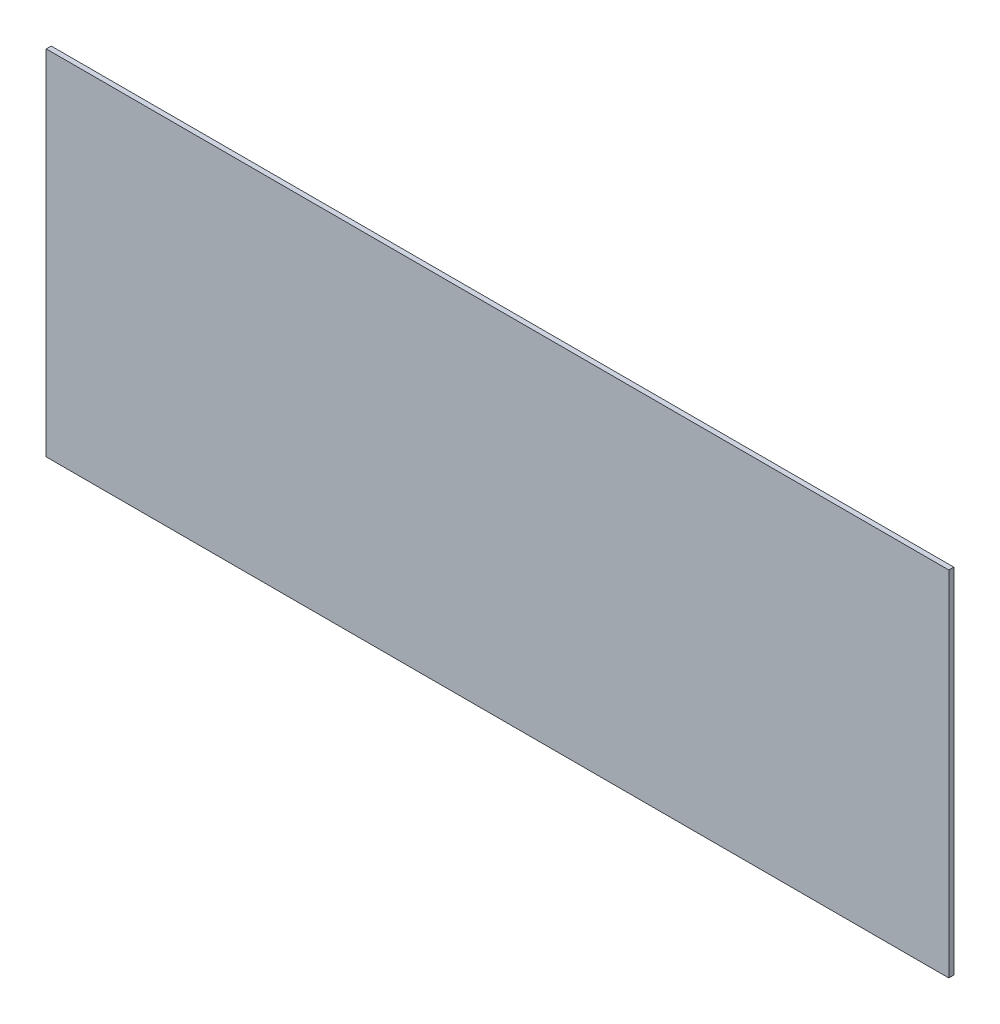
ISO-10303-21;
HEADER;
FILE_DESCRIPTION(('STEP AP214'),'2;1');
FILE_NAME('part.step','',(''),(''),'','','');
FILE_SCHEMA(('AUTOMOTIVE_DESIGN { 1 0 10303 214 1 1 1 1 }'));
ENDSEC;
DATA;
#1=APPLICATION_CONTEXT('core data for automotive mechanical design processes');
#2=APPLICATION_PROTOCOL_DEFINITION('international standard','automotive_design',2000,#1);
#3=PRODUCT_CONTEXT('',#1,'mechanical');
#4=PRODUCT('Part','Part','',(#3));
#5=PRODUCT_RELATED_PRODUCT_CATEGORY('part','',(#4));
#6=PRODUCT_DEFINITION_FORMATION('','',#4);
#7=PRODUCT_DEFINITION_CONTEXT('part definition',#1,'design');
#8=PRODUCT_DEFINITION('design','',#6,#7);
#9=PRODUCT_DEFINITION_SHAPE('','',#8);
#10=(LENGTH_UNIT() NAMED_UNIT(*) SI_UNIT(.MILLI.,.METRE.));
#11=(NAMED_UNIT(*) PLANE_ANGLE_UNIT() SI_UNIT($,.RADIAN.));
#12=(NAMED_UNIT(*) SI_UNIT($,.STERADIAN.) SOLID_ANGLE_UNIT());
#13=UNCERTAINTY_MEASURE_WITH_UNIT(LENGTH_MEASURE(1.E-05),#10,'distance_accuracy_value','');
#14=(GEOMETRIC_REPRESENTATION_CONTEXT(3) GLOBAL_UNCERTAINTY_ASSIGNED_CONTEXT((#13)) GLOBAL_UNIT_ASSIGNED_CONTEXT((#10,
#11,#12)) REPRESENTATION_CONTEXT('',''));
#15=CARTESIAN_POINT('',(0.,0.,0.));
#16=DIRECTION('',(0.,0.,1.));
#17=DIRECTION('',(1.,0.,0.));
#18=AXIS2_PLACEMENT_3D('',#15,#16,#17);
#19=CARTESIAN_POINT('',(3070.63475716415,1138.80969471235,0.127));
#20=DIRECTION('',(1.,0.,0.));
#21=DIRECTION('',(0.,0.,-1.));
#22=AXIS2_PLACEMENT_3D('',#19,#20,#21);
#23=PLANE('',#22);
#24=DIRECTION('',(0.,-1.,0.));
#25=VECTOR('',#24,1.);
#26=CARTESIAN_POINT('',(3070.63475716415,1138.80969471235,0.));
#27=LINE('',#26,#25);
#28=CARTESIAN_POINT('',(3070.63475716415,1138.80969471235,0.));
#29=VERTEX_POINT('',#28);
#30=CARTESIAN_POINT('',(3070.63475716415,1129.80169471236,0.));
#31=VERTEX_POINT('',#30);
#32=EDGE_CURVE('E95',#29,#31,#27,.T.);
#33=ORIENTED_EDGE('',*,*,#32,.T.);
#34=DIRECTION('',(0.,0.,-1.));
#35=VECTOR('',#34,1.);
#36=CARTESIAN_POINT('',(3070.63475716415,1129.80169471236,0.127));
#37=LINE('',#36,#35);
#38=CARTESIAN_POINT('',(3070.63475716415,1129.80169471236,0.127));
#39=VERTEX_POINT('',#38);
#40=EDGE_CURVE('E11',#39,#31,#37,.T.);
#41=ORIENTED_EDGE('',*,*,#40,.F.);
#42=DIRECTION('',(0.,-1.,0.));
#43=VECTOR('',#42,1.);
#44=CARTESIAN_POINT('',(3070.63475716415,1138.80969471235,0.127));
#45=LINE('',#44,#43);
#46=CARTESIAN_POINT('',(3070.63475716415,1138.80969471235,0.127));
#47=VERTEX_POINT('',#46);
#48=EDGE_CURVE('E83',#47,#39,#45,.T.);
#49=ORIENTED_EDGE('',*,*,#48,.F.);
#50=DIRECTION('',(0.,0.,-1.));
#51=VECTOR('',#50,1.);
#52=CARTESIAN_POINT('',(3070.63475716415,1138.80969471235,0.127));
#53=LINE('',#52,#51);
#54=EDGE_CURVE('E91',#47,#29,#53,.T.);
#55=ORIENTED_EDGE('',*,*,#54,.T.);
#56=EDGE_LOOP('',(#33,#41,#49,#55));
#57=FACE_BOUND('',#56,.T.);
#58=ADVANCED_FACE('F32',(#57),#23,.F.);
#59=CARTESIAN_POINT('',(3070.63475716415,1129.80169471236,0.127));
#60=DIRECTION('',(0.,1.,0.));
#61=DIRECTION('',(0.,0.,1.));
#62=AXIS2_PLACEMENT_3D('',#59,#60,#61);
#63=PLANE('',#62);
#64=DIRECTION('',(1.,0.,0.));
#65=VECTOR('',#64,1.);
#66=CARTESIAN_POINT('',(3070.63475716415,1129.80169471236,0.));
#67=LINE('',#66,#65);
#68=CARTESIAN_POINT('',(3093.64275716415,1129.80169471236,0.));
#69=VERTEX_POINT('',#68);
#70=EDGE_CURVE('E87',#31,#69,#67,.T.);
#71=ORIENTED_EDGE('',*,*,#70,.T.);
#72=DIRECTION('',(0.,0.,-1.));
#73=VECTOR('',#72,1.);
#74=CARTESIAN_POINT('',(3093.64275716415,1129.80169471236,0.127));
#75=LINE('',#74,#73);
#76=CARTESIAN_POINT('',(3093.64275716415,1129.80169471236,0.127));
#77=VERTEX_POINT('',#76);
#78=EDGE_CURVE('E40',#77,#69,#75,.T.);
#79=ORIENTED_EDGE('',*,*,#78,.F.);
#80=DIRECTION('',(1.,0.,0.));
#81=VECTOR('',#80,1.);
#82=CARTESIAN_POINT('',(3070.63475716415,1129.80169471236,0.127));
#83=LINE('',#82,#81);
#84=EDGE_CURVE('E78',#39,#77,#83,.T.);
#85=ORIENTED_EDGE('',*,*,#84,.F.);
#86=ORIENTED_EDGE('',*,*,#40,.T.);
#87=EDGE_LOOP('',(#71,#79,#85,#86));
#88=FACE_BOUND('',#87,.T.);
#89=ADVANCED_FACE('F86',(#88),#63,.F.);
#90=CARTESIAN_POINT('',(3093.64275716415,1129.80169471236,0.127));
#91=DIRECTION('',(-1.,0.,0.));
#92=DIRECTION('',(0.,0.,1.));
#93=AXIS2_PLACEMENT_3D('',#90,#91,#92);
#94=PLANE('',#93);
#95=DIRECTION('',(0.,1.,0.));
#96=VECTOR('',#95,1.);
#97=CARTESIAN_POINT('',(3093.64275716415,1129.80169471236,0.));
#98=LINE('',#97,#96);
#99=CARTESIAN_POINT('',(3093.64275716415,1138.80969471235,0.));
#100=VERTEX_POINT('',#99);
#101=EDGE_CURVE('E65',#69,#100,#98,.T.);
#102=ORIENTED_EDGE('',*,*,#101,.T.);
#103=DIRECTION('',(0.,0.,-1.));
#104=VECTOR('',#103,1.);
#105=CARTESIAN_POINT('',(3093.64275716415,1138.80969471235,0.127));
#106=LINE('',#105,#104);
#107=CARTESIAN_POINT('',(3093.64275716415,1138.80969471235,0.127));
#108=VERTEX_POINT('',#107);
#109=EDGE_CURVE('E88',#108,#100,#106,.T.);
#110=ORIENTED_EDGE('',*,*,#109,.F.);
#111=DIRECTION('',(0.,1.,0.));
#112=VECTOR('',#111,1.);
#113=CARTESIAN_POINT('',(3093.64275716415,1129.80169471236,0.127));
#114=LINE('',#113,#112);
#115=EDGE_CURVE('E81',#77,#108,#114,.T.);
#116=ORIENTED_EDGE('',*,*,#115,.F.);
#117=ORIENTED_EDGE('',*,*,#78,.T.);
#118=EDGE_LOOP('',(#102,#110,#116,#117));
#119=FACE_BOUND('',#118,.T.);
#120=ADVANCED_FACE('F89',(#119),#94,.F.);
#121=CARTESIAN_POINT('',(3093.64275716415,1138.80969471235,0.127));
#122=DIRECTION('',(0.,-1.,0.));
#123=DIRECTION('',(0.,0.,-1.));
#124=AXIS2_PLACEMENT_3D('',#121,#122,#123);
#125=PLANE('',#124);
#126=DIRECTION('',(-1.,0.,0.));
#127=VECTOR('',#126,1.);
#128=CARTESIAN_POINT('',(3093.64275716415,1138.80969471235,0.));
#129=LINE('',#128,#127);
#130=EDGE_CURVE('E71',#100,#29,#129,.T.);
#131=ORIENTED_EDGE('',*,*,#130,.T.);
#132=ORIENTED_EDGE('',*,*,#54,.F.);
#133=DIRECTION('',(-1.,0.,0.));
#134=VECTOR('',#133,1.);
#135=CARTESIAN_POINT('',(3093.64275716415,1138.80969471235,0.127));
#136=LINE('',#135,#134);
#137=EDGE_CURVE('E48',#108,#47,#136,.T.);
#138=ORIENTED_EDGE('',*,*,#137,.F.);
#139=ORIENTED_EDGE('',*,*,#109,.T.);
#140=EDGE_LOOP('',(#131,#132,#138,#139));
#141=FACE_BOUND('',#140,.T.);
#142=ADVANCED_FACE('F102',(#141),#125,.F.);
#143=CARTESIAN_POINT('',(0.,0.,0.127));
#144=DIRECTION('',(0.,0.,1.));
#145=DIRECTION('',(1.,0.,0.));
#146=AXIS2_PLACEMENT_3D('',#143,#144,#145);
#147=PLANE('',#146);
#148=ORIENTED_EDGE('',*,*,#48,.T.);
#149=ORIENTED_EDGE('',*,*,#84,.T.);
#150=ORIENTED_EDGE('',*,*,#115,.T.);
#151=ORIENTED_EDGE('',*,*,#137,.T.);
#152=EDGE_LOOP('',(#148,#149,#150,#151));
#153=FACE_BOUND('',#152,.T.);
#154=ADVANCED_FACE('F79',(#153),#147,.T.);
#155=CARTESIAN_POINT('',(0.,0.,0.));
#156=DIRECTION('',(0.,0.,1.));
#157=DIRECTION('',(1.,0.,0.));
#158=AXIS2_PLACEMENT_3D('',#155,#156,#157);
#159=PLANE('',#158);
#160=ORIENTED_EDGE('',*,*,#32,.F.);
#161=ORIENTED_EDGE('',*,*,#130,.F.);
#162=ORIENTED_EDGE('',*,*,#101,.F.);
#163=ORIENTED_EDGE('',*,*,#70,.F.);
#164=EDGE_LOOP('',(#160,#161,#162,#163));
#165=FACE_BOUND('',#164,.T.);
#166=ADVANCED_FACE('F105',(#165),#159,.F.);
#167=CLOSED_SHELL('',(#58,#89,#120,#142,#154,#166));
#168=MANIFOLD_SOLID_BREP('B2',#167);
#169=ADVANCED_BREP_SHAPE_REPRESENTATION('',(#18,#168),#14);
#170=SHAPE_DEFINITION_REPRESENTATION(#9,#169);
ENDSEC;
END-ISO-10303-21;
